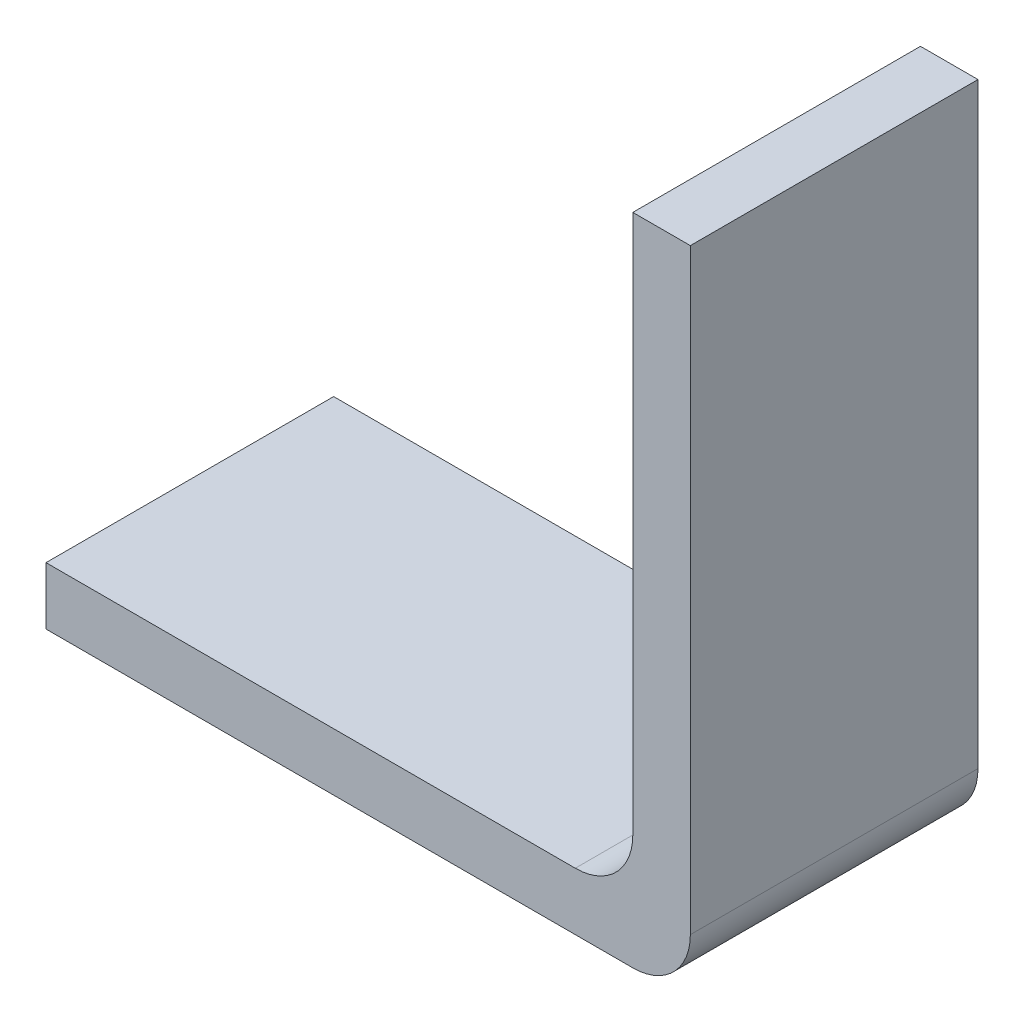
ISO-10303-21;
HEADER;
FILE_DESCRIPTION(('STEP AP214'),'2;1');
FILE_NAME('part.step','',(''),(''),'','','');
FILE_SCHEMA(('AUTOMOTIVE_DESIGN { 1 0 10303 214 1 1 1 1 }'));
ENDSEC;
DATA;
#1=APPLICATION_CONTEXT('core data for automotive mechanical design processes');
#2=APPLICATION_PROTOCOL_DEFINITION('international standard','automotive_design',2000,#1);
#3=PRODUCT_CONTEXT('',#1,'mechanical');
#4=PRODUCT('Part','Part','',(#3));
#5=PRODUCT_RELATED_PRODUCT_CATEGORY('part','',(#4));
#6=PRODUCT_DEFINITION_FORMATION('','',#4);
#7=PRODUCT_DEFINITION_CONTEXT('part definition',#1,'design');
#8=PRODUCT_DEFINITION('design','',#6,#7);
#9=PRODUCT_DEFINITION_SHAPE('','',#8);
#10=(LENGTH_UNIT() NAMED_UNIT(*) SI_UNIT(.MILLI.,.METRE.));
#11=(NAMED_UNIT(*) PLANE_ANGLE_UNIT() SI_UNIT($,.RADIAN.));
#12=(NAMED_UNIT(*) SI_UNIT($,.STERADIAN.) SOLID_ANGLE_UNIT());
#13=UNCERTAINTY_MEASURE_WITH_UNIT(LENGTH_MEASURE(1.E-05),#10,'distance_accuracy_value','');
#14=(GEOMETRIC_REPRESENTATION_CONTEXT(3) GLOBAL_UNCERTAINTY_ASSIGNED_CONTEXT((#13)) GLOBAL_UNIT_ASSIGNED_CONTEXT((#10,
#11,#12)) REPRESENTATION_CONTEXT('',''));
#15=CARTESIAN_POINT('',(0.,0.,0.));
#16=DIRECTION('',(0.,0.,1.));
#17=DIRECTION('',(1.,0.,0.));
#18=AXIS2_PLACEMENT_3D('',#15,#16,#17);
#19=CARTESIAN_POINT('',(82.9905427522806,-32.6813512629,5.));
#20=DIRECTION('',(0.,-1.,0.));
#21=DIRECTION('',(0.,0.,-1.));
#22=AXIS2_PLACEMENT_3D('',#19,#20,#21);
#23=PLANE('',#22);
#24=DIRECTION('',(1.,0.,0.));
#25=VECTOR('',#24,1.);
#26=CARTESIAN_POINT('',(82.9905427522806,-32.6813512629,5.));
#27=LINE('',#26,#25);
#28=CARTESIAN_POINT('',(80.9905427522806,-32.6813512629,5.));
#29=VERTEX_POINT('',#28);
#30=CARTESIAN_POINT('',(71.7905427522806,-32.6813512629,5.));
#31=VERTEX_POINT('',#30);
#32=EDGE_CURVE('E96',#29,#31,#27,.F.);
#33=ORIENTED_EDGE('',*,*,#32,.F.);
#34=DIRECTION('',(0.,0.,-1.));
#35=VECTOR('',#34,1.);
#36=CARTESIAN_POINT('',(80.9905427522806,-32.6813512629,0.));
#37=LINE('',#36,#35);
#38=CARTESIAN_POINT('',(80.9905427522806,-32.6813512629,0.));
#39=VERTEX_POINT('',#38);
#40=EDGE_CURVE('E115',#29,#39,#37,.T.);
#41=ORIENTED_EDGE('',*,*,#40,.T.);
#42=DIRECTION('',(1.,0.,0.));
#43=VECTOR('',#42,1.);
#44=CARTESIAN_POINT('',(82.9905427522806,-32.6813512629,0.));
#45=LINE('',#44,#43);
#46=CARTESIAN_POINT('',(71.7905427522806,-32.6813512629,0.));
#47=VERTEX_POINT('',#46);
#48=EDGE_CURVE('E111',#39,#47,#45,.F.);
#49=ORIENTED_EDGE('',*,*,#48,.T.);
#50=DIRECTION('',(0.,0.,-1.));
#51=VECTOR('',#50,1.);
#52=CARTESIAN_POINT('',(71.7905427522806,-32.6813512629,5.));
#53=LINE('',#52,#51);
#54=EDGE_CURVE('E109',#31,#47,#53,.T.);
#55=ORIENTED_EDGE('',*,*,#54,.F.);
#56=EDGE_LOOP('',(#33,#41,#49,#55));
#57=FACE_BOUND('',#56,.T.);
#58=ADVANCED_FACE('F32',(#57),#23,.F.);
#59=CARTESIAN_POINT('',(71.7905427522806,-33.6813512629,5.));
#60=DIRECTION('',(-1.,0.,0.));
#61=DIRECTION('',(0.,0.,1.));
#62=AXIS2_PLACEMENT_3D('',#59,#60,#61);
#63=PLANE('',#62);
#64=DIRECTION('',(0.,1.,0.));
#65=VECTOR('',#64,1.);
#66=CARTESIAN_POINT('',(71.7905427522806,-33.6813512629,0.));
#67=LINE('',#66,#65);
#68=CARTESIAN_POINT('',(71.7905427522806,-33.6813512629,0.));
#69=VERTEX_POINT('',#68);
#70=EDGE_CURVE('E135',#69,#47,#67,.T.);
#71=ORIENTED_EDGE('',*,*,#70,.F.);
#72=DIRECTION('',(0.,0.,-1.));
#73=VECTOR('',#72,1.);
#74=CARTESIAN_POINT('',(71.7905427522806,-33.6813512629,5.));
#75=LINE('',#74,#73);
#76=CARTESIAN_POINT('',(71.7905427522806,-33.6813512629,5.));
#77=VERTEX_POINT('',#76);
#78=EDGE_CURVE('E116',#77,#69,#75,.T.);
#79=ORIENTED_EDGE('',*,*,#78,.F.);
#80=DIRECTION('',(0.,1.,0.));
#81=VECTOR('',#80,1.);
#82=CARTESIAN_POINT('',(71.7905427522806,-33.6813512629,5.));
#83=LINE('',#82,#81);
#84=EDGE_CURVE('E100',#77,#31,#83,.T.);
#85=ORIENTED_EDGE('',*,*,#84,.T.);
#86=ORIENTED_EDGE('',*,*,#54,.T.);
#87=EDGE_LOOP('',(#71,#79,#85,#86));
#88=FACE_BOUND('',#87,.T.);
#89=ADVANCED_FACE('F119',(#88),#63,.T.);
#90=CARTESIAN_POINT('',(82.9905427522806,-33.6813512629,5.));
#91=DIRECTION('',(0.,-1.,0.));
#92=DIRECTION('',(0.,0.,-1.));
#93=AXIS2_PLACEMENT_3D('',#90,#91,#92);
#94=PLANE('',#93);
#95=DIRECTION('',(-1.,0.,0.));
#96=VECTOR('',#95,1.);
#97=CARTESIAN_POINT('',(82.9905427522806,-33.6813512629,0.));
#98=LINE('',#97,#96);
#99=CARTESIAN_POINT('',(81.9905427522806,-33.6813512629,0.));
#100=VERTEX_POINT('',#99);
#101=EDGE_CURVE('E137',#100,#69,#98,.T.);
#102=ORIENTED_EDGE('',*,*,#101,.F.);
#103=DIRECTION('',(0.,0.,-1.));
#104=VECTOR('',#103,1.);
#105=CARTESIAN_POINT('',(81.9905427522806,-33.6813512629,5.));
#106=LINE('',#105,#104);
#107=CARTESIAN_POINT('',(81.9905427522806,-33.6813512629,5.));
#108=VERTEX_POINT('',#107);
#109=EDGE_CURVE('E47',#100,#108,#106,.F.);
#110=ORIENTED_EDGE('',*,*,#109,.T.);
#111=DIRECTION('',(-1.,0.,0.));
#112=VECTOR('',#111,1.);
#113=CARTESIAN_POINT('',(82.9905427522806,-33.6813512629,5.));
#114=LINE('',#113,#112);
#115=EDGE_CURVE('E121',#108,#77,#114,.T.);
#116=ORIENTED_EDGE('',*,*,#115,.T.);
#117=ORIENTED_EDGE('',*,*,#78,.T.);
#118=EDGE_LOOP('',(#102,#110,#116,#117));
#119=FACE_BOUND('',#118,.T.);
#120=ADVANCED_FACE('F180',(#119),#94,.T.);
#121=CARTESIAN_POINT('',(82.9905427522806,-22.3088399013069,5.));
#122=DIRECTION('',(1.,0.,0.));
#123=DIRECTION('',(0.,0.,-1.));
#124=AXIS2_PLACEMENT_3D('',#121,#122,#123);
#125=PLANE('',#124);
#126=DIRECTION('',(0.,-1.,0.));
#127=VECTOR('',#126,1.);
#128=CARTESIAN_POINT('',(82.9905427522806,-22.3088399013069,5.));
#129=LINE('',#128,#127);
#130=CARTESIAN_POINT('',(82.9905427522806,-22.3088399013069,5.));
#131=VERTEX_POINT('',#130);
#132=CARTESIAN_POINT('',(82.9905427522806,-32.6813512629,5.));
#133=VERTEX_POINT('',#132);
#134=EDGE_CURVE('E123',#131,#133,#129,.T.);
#135=ORIENTED_EDGE('',*,*,#134,.T.);
#136=DIRECTION('',(0.,0.,-1.));
#137=VECTOR('',#136,1.);
#138=CARTESIAN_POINT('',(82.9905427522806,-32.6813512629,5.));
#139=LINE('',#138,#137);
#140=CARTESIAN_POINT('',(82.9905427522806,-32.6813512629,0.));
#141=VERTEX_POINT('',#140);
#142=EDGE_CURVE('E153',#133,#141,#139,.T.);
#143=ORIENTED_EDGE('',*,*,#142,.T.);
#144=DIRECTION('',(0.,-1.,0.));
#145=VECTOR('',#144,1.);
#146=CARTESIAN_POINT('',(82.9905427522806,-22.3088399013069,0.));
#147=LINE('',#146,#145);
#148=CARTESIAN_POINT('',(82.9905427522806,-22.3088399013069,0.));
#149=VERTEX_POINT('',#148);
#150=EDGE_CURVE('E139',#149,#141,#147,.T.);
#151=ORIENTED_EDGE('',*,*,#150,.F.);
#152=DIRECTION('',(0.,0.,-1.));
#153=VECTOR('',#152,1.);
#154=CARTESIAN_POINT('',(82.9905427522806,-22.3088399013069,5.));
#155=LINE('',#154,#153);
#156=EDGE_CURVE('E147',#131,#149,#155,.T.);
#157=ORIENTED_EDGE('',*,*,#156,.F.);
#158=EDGE_LOOP('',(#135,#143,#151,#157));
#159=FACE_BOUND('',#158,.T.);
#160=ADVANCED_FACE('F185',(#159),#125,.T.);
#161=CARTESIAN_POINT('',(81.9905427522806,-22.3088399013069,5.));
#162=DIRECTION('',(0.,1.,0.));
#163=DIRECTION('',(0.,0.,1.));
#164=AXIS2_PLACEMENT_3D('',#161,#162,#163);
#165=PLANE('',#164);
#166=DIRECTION('',(1.,0.,0.));
#167=VECTOR('',#166,1.);
#168=CARTESIAN_POINT('',(81.9905427522806,-22.3088399013069,0.));
#169=LINE('',#168,#167);
#170=CARTESIAN_POINT('',(81.9905427522806,-22.3088399013069,0.));
#171=VERTEX_POINT('',#170);
#172=EDGE_CURVE('E141',#171,#149,#169,.T.);
#173=ORIENTED_EDGE('',*,*,#172,.F.);
#174=DIRECTION('',(0.,0.,-1.));
#175=VECTOR('',#174,1.);
#176=CARTESIAN_POINT('',(81.9905427522806,-22.3088399013069,5.));
#177=LINE('',#176,#175);
#178=CARTESIAN_POINT('',(81.9905427522806,-22.3088399013069,5.));
#179=VERTEX_POINT('',#178);
#180=EDGE_CURVE('E133',#179,#171,#177,.T.);
#181=ORIENTED_EDGE('',*,*,#180,.F.);
#182=DIRECTION('',(1.,0.,0.));
#183=VECTOR('',#182,1.);
#184=CARTESIAN_POINT('',(81.9905427522806,-22.3088399013069,5.));
#185=LINE('',#184,#183);
#186=EDGE_CURVE('E128',#179,#131,#185,.T.);
#187=ORIENTED_EDGE('',*,*,#186,.T.);
#188=ORIENTED_EDGE('',*,*,#156,.T.);
#189=EDGE_LOOP('',(#173,#181,#187,#188));
#190=FACE_BOUND('',#189,.T.);
#191=ADVANCED_FACE('F188',(#190),#165,.T.);
#192=CARTESIAN_POINT('',(81.9905427522806,-22.3088399013069,5.));
#193=DIRECTION('',(1.,0.,0.));
#194=DIRECTION('',(0.,0.,-1.));
#195=AXIS2_PLACEMENT_3D('',#192,#193,#194);
#196=PLANE('',#195);
#197=DIRECTION('',(0.,1.,0.));
#198=VECTOR('',#197,1.);
#199=CARTESIAN_POINT('',(81.9905427522806,-22.3088399013069,0.));
#200=LINE('',#199,#198);
#201=CARTESIAN_POINT('',(81.9905427522806,-31.6813512628999,0.));
#202=VERTEX_POINT('',#201);
#203=EDGE_CURVE('E106',#171,#202,#200,.F.);
#204=ORIENTED_EDGE('',*,*,#203,.T.);
#205=DIRECTION('',(0.,0.,-1.));
#206=VECTOR('',#205,1.);
#207=CARTESIAN_POINT('',(81.9905427522806,-31.6813512628999,5.));
#208=LINE('',#207,#206);
#209=CARTESIAN_POINT('',(81.9905427522806,-31.6813512628999,5.));
#210=VERTEX_POINT('',#209);
#211=EDGE_CURVE('E151',#202,#210,#208,.F.);
#212=ORIENTED_EDGE('',*,*,#211,.T.);
#213=DIRECTION('',(0.,1.,0.));
#214=VECTOR('',#213,1.);
#215=CARTESIAN_POINT('',(81.9905427522806,-22.3088399013069,5.));
#216=LINE('',#215,#214);
#217=EDGE_CURVE('E131',#179,#210,#216,.F.);
#218=ORIENTED_EDGE('',*,*,#217,.F.);
#219=ORIENTED_EDGE('',*,*,#180,.T.);
#220=EDGE_LOOP('',(#204,#212,#218,#219));
#221=FACE_BOUND('',#220,.T.);
#222=ADVANCED_FACE('F165',(#221),#196,.F.);
#223=CARTESIAN_POINT('',(0.,0.,5.));
#224=DIRECTION('',(0.,0.,1.));
#225=DIRECTION('',(1.,0.,0.));
#226=AXIS2_PLACEMENT_3D('',#223,#224,#225);
#227=PLANE('',#226);
#228=ORIENTED_EDGE('',*,*,#115,.F.);
#229=CARTESIAN_POINT('',(81.9905427522806,-32.6813512629,5.));
#230=DIRECTION('',(0.,0.,1.));
#231=DIRECTION('',(1.,0.,0.));
#232=AXIS2_PLACEMENT_3D('',#229,#230,#231);
#233=CIRCLE('',#232,1.);
#234=EDGE_CURVE('E158',#108,#133,#233,.T.);
#235=ORIENTED_EDGE('',*,*,#234,.T.);
#236=ORIENTED_EDGE('',*,*,#134,.F.);
#237=ORIENTED_EDGE('',*,*,#186,.F.);
#238=ORIENTED_EDGE('',*,*,#217,.T.);
#239=CARTESIAN_POINT('',(80.9905427522806,-31.6813512628999,5.));
#240=DIRECTION('',(0.,0.,1.));
#241=DIRECTION('',(1.,0.,0.));
#242=AXIS2_PLACEMENT_3D('',#239,#240,#241);
#243=CIRCLE('',#242,1.);
#244=EDGE_CURVE('E11',#210,#29,#243,.F.);
#245=ORIENTED_EDGE('',*,*,#244,.T.);
#246=ORIENTED_EDGE('',*,*,#32,.T.);
#247=ORIENTED_EDGE('',*,*,#84,.F.);
#248=EDGE_LOOP('',(#228,#235,#236,#237,#238,#245,#246,#247));
#249=FACE_BOUND('',#248,.T.);
#250=ADVANCED_FACE('F98',(#249),#227,.T.);
#251=CARTESIAN_POINT('',(0.,0.,0.));
#252=DIRECTION('',(0.,0.,1.));
#253=DIRECTION('',(1.,0.,0.));
#254=AXIS2_PLACEMENT_3D('',#251,#252,#253);
#255=PLANE('',#254);
#256=ORIENTED_EDGE('',*,*,#150,.T.);
#257=CARTESIAN_POINT('',(81.9905427522806,-32.6813512629,0.));
#258=DIRECTION('',(0.,0.,1.));
#259=DIRECTION('',(1.,0.,0.));
#260=AXIS2_PLACEMENT_3D('',#257,#258,#259);
#261=CIRCLE('',#260,1.);
#262=EDGE_CURVE('E55',#141,#100,#261,.F.);
#263=ORIENTED_EDGE('',*,*,#262,.T.);
#264=ORIENTED_EDGE('',*,*,#101,.T.);
#265=ORIENTED_EDGE('',*,*,#70,.T.);
#266=ORIENTED_EDGE('',*,*,#48,.F.);
#267=CARTESIAN_POINT('',(80.9905427522806,-31.6813512628999,0.));
#268=DIRECTION('',(0.,0.,1.));
#269=DIRECTION('',(1.,0.,0.));
#270=AXIS2_PLACEMENT_3D('',#267,#268,#269);
#271=CIRCLE('',#270,1.);
#272=EDGE_CURVE('E40',#39,#202,#271,.T.);
#273=ORIENTED_EDGE('',*,*,#272,.T.);
#274=ORIENTED_EDGE('',*,*,#203,.F.);
#275=ORIENTED_EDGE('',*,*,#172,.T.);
#276=EDGE_LOOP('',(#256,#263,#264,#265,#266,#273,#274,#275));
#277=FACE_BOUND('',#276,.T.);
#278=ADVANCED_FACE('F160',(#277),#255,.F.);
#279=CARTESIAN_POINT('',(80.9905427522806,-31.6813512628999,5.));
#280=DIRECTION('',(0.,0.,1.));
#281=DIRECTION('',(1.,0.,0.));
#282=AXIS2_PLACEMENT_3D('',#279,#280,#281);
#283=CYLINDRICAL_SURFACE('',#282,1.);
#284=ORIENTED_EDGE('',*,*,#244,.F.);
#285=ORIENTED_EDGE('',*,*,#211,.F.);
#286=ORIENTED_EDGE('',*,*,#272,.F.);
#287=ORIENTED_EDGE('',*,*,#40,.F.);
#288=EDGE_LOOP('',(#284,#285,#286,#287));
#289=FACE_BOUND('',#288,.T.);
#290=ADVANCED_FACE('F167',(#289),#283,.F.);
#291=CARTESIAN_POINT('',(81.9905427522806,-32.6813512629,5.));
#292=DIRECTION('',(0.,0.,-1.));
#293=DIRECTION('',(-1.,0.,0.));
#294=AXIS2_PLACEMENT_3D('',#291,#292,#293);
#295=CYLINDRICAL_SURFACE('',#294,1.);
#296=ORIENTED_EDGE('',*,*,#234,.F.);
#297=ORIENTED_EDGE('',*,*,#109,.F.);
#298=ORIENTED_EDGE('',*,*,#262,.F.);
#299=ORIENTED_EDGE('',*,*,#142,.F.);
#300=EDGE_LOOP('',(#296,#297,#298,#299));
#301=FACE_BOUND('',#300,.T.);
#302=ADVANCED_FACE('F34',(#301),#295,.T.);
#303=CLOSED_SHELL('',(#58,#89,#120,#160,#191,#222,#250,#278,#290,#302));
#304=MANIFOLD_SOLID_BREP('B2',#303);
#305=ADVANCED_BREP_SHAPE_REPRESENTATION('',(#18,#304),#14);
#306=SHAPE_DEFINITION_REPRESENTATION(#9,#305);
ENDSEC;
END-ISO-10303-21;
